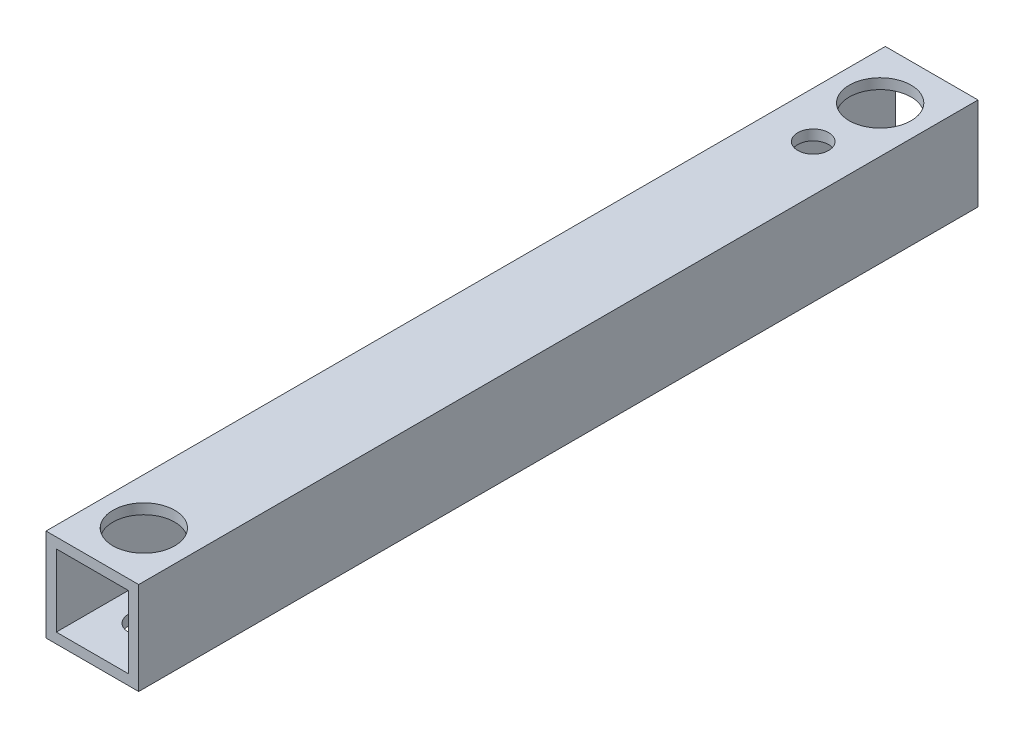
ISO-10303-21;
HEADER;
FILE_DESCRIPTION(('STEP AP214'),'2;1');
FILE_NAME('part.step','',(''),(''),'','','');
FILE_SCHEMA(('AUTOMOTIVE_DESIGN { 1 0 10303 214 1 1 1 1 }'));
ENDSEC;
DATA;
#1=APPLICATION_CONTEXT('core data for automotive mechanical design processes');
#2=APPLICATION_PROTOCOL_DEFINITION('international standard','automotive_design',2000,#1);
#3=PRODUCT_CONTEXT('',#1,'mechanical');
#4=PRODUCT('Part','Part','',(#3));
#5=PRODUCT_RELATED_PRODUCT_CATEGORY('part','',(#4));
#6=PRODUCT_DEFINITION_FORMATION('','',#4);
#7=PRODUCT_DEFINITION_CONTEXT('part definition',#1,'design');
#8=PRODUCT_DEFINITION('design','',#6,#7);
#9=PRODUCT_DEFINITION_SHAPE('','',#8);
#10=(LENGTH_UNIT() NAMED_UNIT(*) SI_UNIT(.MILLI.,.METRE.));
#11=(NAMED_UNIT(*) PLANE_ANGLE_UNIT() SI_UNIT($,.RADIAN.));
#12=(NAMED_UNIT(*) SI_UNIT($,.STERADIAN.) SOLID_ANGLE_UNIT());
#13=UNCERTAINTY_MEASURE_WITH_UNIT(LENGTH_MEASURE(1.E-05),#10,'distance_accuracy_value','');
#14=(GEOMETRIC_REPRESENTATION_CONTEXT(3) GLOBAL_UNCERTAINTY_ASSIGNED_CONTEXT((#13)) GLOBAL_UNIT_ASSIGNED_CONTEXT((#10,
#11,#12)) REPRESENTATION_CONTEXT('',''));
#15=CARTESIAN_POINT('',(0.,0.,0.));
#16=DIRECTION('',(0.,0.,1.));
#17=DIRECTION('',(1.,0.,0.));
#18=AXIS2_PLACEMENT_3D('',#15,#16,#17);
#19=CARTESIAN_POINT('',(4.5,4.5,81.5));
#20=DIRECTION('',(-1.,0.,0.));
#21=DIRECTION('',(0.,0.,1.));
#22=AXIS2_PLACEMENT_3D('',#19,#20,#21);
#23=PLANE('',#22);
#24=DIRECTION('',(0.,1.,0.));
#25=VECTOR('',#24,1.);
#26=CARTESIAN_POINT('',(4.5,4.5,0.));
#27=LINE('',#26,#25);
#28=CARTESIAN_POINT('',(4.5,-4.5,0.));
#29=VERTEX_POINT('',#28);
#30=CARTESIAN_POINT('',(4.5,4.5,0.));
#31=VERTEX_POINT('',#30);
#32=EDGE_CURVE('E136',#29,#31,#27,.T.);
#33=ORIENTED_EDGE('',*,*,#32,.T.);
#34=DIRECTION('',(0.,0.,-1.));
#35=VECTOR('',#34,1.);
#36=CARTESIAN_POINT('',(4.5,4.5,81.5));
#37=LINE('',#36,#35);
#38=CARTESIAN_POINT('',(4.5,4.5,81.5));
#39=VERTEX_POINT('',#38);
#40=EDGE_CURVE('E178',#39,#31,#37,.T.);
#41=ORIENTED_EDGE('',*,*,#40,.F.);
#42=DIRECTION('',(0.,1.,0.));
#43=VECTOR('',#42,1.);
#44=CARTESIAN_POINT('',(4.5,4.5,81.5));
#45=LINE('',#44,#43);
#46=CARTESIAN_POINT('',(4.5,-4.5,81.5));
#47=VERTEX_POINT('',#46);
#48=EDGE_CURVE('E141',#47,#39,#45,.T.);
#49=ORIENTED_EDGE('',*,*,#48,.F.);
#50=DIRECTION('',(0.,0.,-1.));
#51=VECTOR('',#50,1.);
#52=CARTESIAN_POINT('',(4.5,-4.5,81.5));
#53=LINE('',#52,#51);
#54=EDGE_CURVE('E155',#47,#29,#53,.T.);
#55=ORIENTED_EDGE('',*,*,#54,.T.);
#56=EDGE_LOOP('',(#33,#41,#49,#55));
#57=FACE_BOUND('',#56,.T.);
#58=ADVANCED_FACE('F38',(#57),#23,.F.);
#59=CARTESIAN_POINT('',(-4.5,4.5,81.5));
#60=DIRECTION('',(0.,-1.,0.));
#61=DIRECTION('',(0.,0.,-1.));
#62=AXIS2_PLACEMENT_3D('',#59,#60,#61);
#63=PLANE('',#62);
#64=CARTESIAN_POINT('',(0.,4.5,76.5));
#65=DIRECTION('',(0.,1.,0.));
#66=DIRECTION('',(0.,0.,1.));
#67=AXIS2_PLACEMENT_3D('',#64,#65,#66);
#68=CIRCLE('',#67,3.);
#69=CARTESIAN_POINT('',(0.,4.5,79.5));
#70=VERTEX_POINT('',#69);
#71=EDGE_CURVE('E211',#70,#70,#68,.T.);
#72=ORIENTED_EDGE('',*,*,#71,.F.);
#73=EDGE_LOOP('',(#72));
#74=FACE_BOUND('',#73,.T.);
#75=CARTESIAN_POINT('',(0.,4.5,5.));
#76=DIRECTION('',(0.,1.,0.));
#77=DIRECTION('',(0.,0.,1.));
#78=AXIS2_PLACEMENT_3D('',#75,#76,#77);
#79=CIRCLE('',#78,3.);
#80=CARTESIAN_POINT('',(0.,4.5,8.));
#81=VERTEX_POINT('',#80);
#82=EDGE_CURVE('E193',#81,#81,#79,.T.);
#83=ORIENTED_EDGE('',*,*,#82,.F.);
#84=EDGE_LOOP('',(#83));
#85=FACE_BOUND('',#84,.T.);
#86=CARTESIAN_POINT('',(0.,4.5,11.5));
#87=DIRECTION('',(0.,1.,0.));
#88=DIRECTION('',(0.,0.,1.));
#89=AXIS2_PLACEMENT_3D('',#86,#87,#88);
#90=CIRCLE('',#89,1.5);
#91=CARTESIAN_POINT('',(0.,4.5,13.));
#92=VERTEX_POINT('',#91);
#93=EDGE_CURVE('E202',#92,#92,#90,.T.);
#94=ORIENTED_EDGE('',*,*,#93,.F.);
#95=EDGE_LOOP('',(#94));
#96=FACE_BOUND('',#95,.T.);
#97=DIRECTION('',(-1.,0.,0.));
#98=VECTOR('',#97,1.);
#99=CARTESIAN_POINT('',(-4.5,4.5,0.));
#100=LINE('',#99,#98);
#101=CARTESIAN_POINT('',(-4.5,4.5,0.));
#102=VERTEX_POINT('',#101);
#103=EDGE_CURVE('E159',#31,#102,#100,.T.);
#104=ORIENTED_EDGE('',*,*,#103,.T.);
#105=DIRECTION('',(0.,0.,-1.));
#106=VECTOR('',#105,1.);
#107=CARTESIAN_POINT('',(-4.5,4.5,81.5));
#108=LINE('',#107,#106);
#109=CARTESIAN_POINT('',(-4.5,4.5,81.5));
#110=VERTEX_POINT('',#109);
#111=EDGE_CURVE('E174',#110,#102,#108,.T.);
#112=ORIENTED_EDGE('',*,*,#111,.F.);
#113=DIRECTION('',(-1.,0.,0.));
#114=VECTOR('',#113,1.);
#115=CARTESIAN_POINT('',(-4.5,4.5,81.5));
#116=LINE('',#115,#114);
#117=EDGE_CURVE('E145',#39,#110,#116,.T.);
#118=ORIENTED_EDGE('',*,*,#117,.F.);
#119=ORIENTED_EDGE('',*,*,#40,.T.);
#120=EDGE_LOOP('',(#104,#112,#118,#119));
#121=FACE_BOUND('',#120,.T.);
#122=ADVANCED_FACE('F258',(#74,#85,#96,#121),#63,.F.);
#123=CARTESIAN_POINT('',(-4.5,4.5,81.5));
#124=DIRECTION('',(1.,0.,0.));
#125=DIRECTION('',(0.,1.,0.));
#126=AXIS2_PLACEMENT_3D('',#123,#124,#125);
#127=PLANE('',#126);
#128=DIRECTION('',(0.,-1.,0.));
#129=VECTOR('',#128,1.);
#130=CARTESIAN_POINT('',(-4.5,4.5,0.));
#131=LINE('',#130,#129);
#132=CARTESIAN_POINT('',(-4.5,-4.5,0.));
#133=VERTEX_POINT('',#132);
#134=EDGE_CURVE('E162',#102,#133,#131,.T.);
#135=ORIENTED_EDGE('',*,*,#134,.T.);
#136=DIRECTION('',(0.,0.,-1.));
#137=VECTOR('',#136,1.);
#138=CARTESIAN_POINT('',(-4.5,-4.5,81.5));
#139=LINE('',#138,#137);
#140=CARTESIAN_POINT('',(-4.5,-4.5,81.5));
#141=VERTEX_POINT('',#140);
#142=EDGE_CURVE('E170',#141,#133,#139,.T.);
#143=ORIENTED_EDGE('',*,*,#142,.F.);
#144=DIRECTION('',(0.,-1.,0.));
#145=VECTOR('',#144,1.);
#146=CARTESIAN_POINT('',(-4.5,4.5,81.5));
#147=LINE('',#146,#145);
#148=EDGE_CURVE('E149',#110,#141,#147,.T.);
#149=ORIENTED_EDGE('',*,*,#148,.F.);
#150=ORIENTED_EDGE('',*,*,#111,.T.);
#151=EDGE_LOOP('',(#135,#143,#149,#150));
#152=FACE_BOUND('',#151,.T.);
#153=ADVANCED_FACE('F264',(#152),#127,.F.);
#154=CARTESIAN_POINT('',(-4.5,-4.5,81.5));
#155=DIRECTION('',(0.,1.,0.));
#156=DIRECTION('',(0.,0.,1.));
#157=AXIS2_PLACEMENT_3D('',#154,#155,#156);
#158=PLANE('',#157);
#159=CARTESIAN_POINT('',(0.,-4.5,5.));
#160=DIRECTION('',(0.,1.,0.));
#161=DIRECTION('',(0.,0.,1.));
#162=AXIS2_PLACEMENT_3D('',#159,#160,#161);
#163=CIRCLE('',#162,3.);
#164=CARTESIAN_POINT('',(0.,-4.5,8.));
#165=VERTEX_POINT('',#164);
#166=EDGE_CURVE('E229',#165,#165,#163,.T.);
#167=ORIENTED_EDGE('',*,*,#166,.T.);
#168=EDGE_LOOP('',(#167));
#169=FACE_BOUND('',#168,.T.);
#170=CARTESIAN_POINT('',(0.,-4.5,76.5));
#171=DIRECTION('',(0.,1.,0.));
#172=DIRECTION('',(0.,0.,1.));
#173=AXIS2_PLACEMENT_3D('',#170,#171,#172);
#174=CIRCLE('',#173,1.5);
#175=CARTESIAN_POINT('',(0.,-4.5,78.));
#176=VERTEX_POINT('',#175);
#177=EDGE_CURVE('E221',#176,#176,#174,.T.);
#178=ORIENTED_EDGE('',*,*,#177,.T.);
#179=EDGE_LOOP('',(#178));
#180=FACE_BOUND('',#179,.T.);
#181=CARTESIAN_POINT('',(0.,-4.5,11.5));
#182=DIRECTION('',(0.,1.,0.));
#183=DIRECTION('',(0.,0.,1.));
#184=AXIS2_PLACEMENT_3D('',#181,#182,#183);
#185=CIRCLE('',#184,1.5);
#186=CARTESIAN_POINT('',(0.,-4.5,13.));
#187=VERTEX_POINT('',#186);
#188=EDGE_CURVE('E199',#187,#187,#185,.T.);
#189=ORIENTED_EDGE('',*,*,#188,.T.);
#190=EDGE_LOOP('',(#189));
#191=FACE_BOUND('',#190,.T.);
#192=DIRECTION('',(1.,0.,0.));
#193=VECTOR('',#192,1.);
#194=CARTESIAN_POINT('',(-4.5,-4.5,0.));
#195=LINE('',#194,#193);
#196=EDGE_CURVE('E146',#133,#29,#195,.T.);
#197=ORIENTED_EDGE('',*,*,#196,.T.);
#198=ORIENTED_EDGE('',*,*,#54,.F.);
#199=DIRECTION('',(1.,0.,0.));
#200=VECTOR('',#199,1.);
#201=CARTESIAN_POINT('',(-4.5,-4.5,81.5));
#202=LINE('',#201,#200);
#203=EDGE_CURVE('E152',#141,#47,#202,.T.);
#204=ORIENTED_EDGE('',*,*,#203,.F.);
#205=ORIENTED_EDGE('',*,*,#142,.T.);
#206=EDGE_LOOP('',(#197,#198,#204,#205));
#207=FACE_BOUND('',#206,.T.);
#208=ADVANCED_FACE('F280',(#169,#180,#191,#207),#158,.F.);
#209=CARTESIAN_POINT('',(0.,0.,81.5));
#210=DIRECTION('',(0.,0.,1.));
#211=DIRECTION('',(1.,0.,0.));
#212=AXIS2_PLACEMENT_3D('',#209,#210,#211);
#213=PLANE('',#212);
#214=DIRECTION('',(0.,1.,0.));
#215=VECTOR('',#214,1.);
#216=CARTESIAN_POINT('',(3.5,3.5,81.5));
#217=LINE('',#216,#215);
#218=CARTESIAN_POINT('',(3.5,-3.5,81.5));
#219=VERTEX_POINT('',#218);
#220=CARTESIAN_POINT('',(3.5,3.5,81.5));
#221=VERTEX_POINT('',#220);
#222=EDGE_CURVE('E55',#219,#221,#217,.T.);
#223=ORIENTED_EDGE('',*,*,#222,.F.);
#224=DIRECTION('',(1.,0.,0.));
#225=VECTOR('',#224,1.);
#226=CARTESIAN_POINT('',(-3.5,-3.5,81.5));
#227=LINE('',#226,#225);
#228=CARTESIAN_POINT('',(-3.5,-3.5,81.5));
#229=VERTEX_POINT('',#228);
#230=EDGE_CURVE('E126',#229,#219,#227,.T.);
#231=ORIENTED_EDGE('',*,*,#230,.F.);
#232=DIRECTION('',(0.,-1.,0.));
#233=VECTOR('',#232,1.);
#234=CARTESIAN_POINT('',(-3.5,3.5,81.5));
#235=LINE('',#234,#233);
#236=CARTESIAN_POINT('',(-3.5,3.5,81.5));
#237=VERTEX_POINT('',#236);
#238=EDGE_CURVE('E108',#237,#229,#235,.T.);
#239=ORIENTED_EDGE('',*,*,#238,.F.);
#240=DIRECTION('',(-1.,0.,0.));
#241=VECTOR('',#240,1.);
#242=CARTESIAN_POINT('',(-3.5,3.5,81.5));
#243=LINE('',#242,#241);
#244=EDGE_CURVE('E118',#221,#237,#243,.T.);
#245=ORIENTED_EDGE('',*,*,#244,.F.);
#246=EDGE_LOOP('',(#223,#231,#239,#245));
#247=FACE_BOUND('',#246,.T.);
#248=ORIENTED_EDGE('',*,*,#48,.T.);
#249=ORIENTED_EDGE('',*,*,#117,.T.);
#250=ORIENTED_EDGE('',*,*,#148,.T.);
#251=ORIENTED_EDGE('',*,*,#203,.T.);
#252=EDGE_LOOP('',(#248,#249,#250,#251));
#253=FACE_BOUND('',#252,.T.);
#254=ADVANCED_FACE('F123',(#247,#253),#213,.T.);
#255=CARTESIAN_POINT('',(0.,0.,0.));
#256=DIRECTION('',(0.,0.,1.));
#257=DIRECTION('',(1.,0.,0.));
#258=AXIS2_PLACEMENT_3D('',#255,#256,#257);
#259=PLANE('',#258);
#260=DIRECTION('',(1.,0.,0.));
#261=VECTOR('',#260,1.);
#262=CARTESIAN_POINT('',(0.,-3.5,0.));
#263=LINE('',#262,#261);
#264=CARTESIAN_POINT('',(-3.5,-3.5,0.));
#265=VERTEX_POINT('',#264);
#266=CARTESIAN_POINT('',(3.5,-3.5,0.));
#267=VERTEX_POINT('',#266);
#268=EDGE_CURVE('E47',#265,#267,#263,.T.);
#269=ORIENTED_EDGE('',*,*,#268,.T.);
#270=DIRECTION('',(0.,1.,0.));
#271=VECTOR('',#270,1.);
#272=CARTESIAN_POINT('',(3.5,0.,0.));
#273=LINE('',#272,#271);
#274=CARTESIAN_POINT('',(3.5,3.5,0.));
#275=VERTEX_POINT('',#274);
#276=EDGE_CURVE('E11',#267,#275,#273,.T.);
#277=ORIENTED_EDGE('',*,*,#276,.T.);
#278=DIRECTION('',(-1.,0.,0.));
#279=VECTOR('',#278,1.);
#280=CARTESIAN_POINT('',(0.,3.5,0.));
#281=LINE('',#280,#279);
#282=CARTESIAN_POINT('',(-3.5,3.5,0.));
#283=VERTEX_POINT('',#282);
#284=EDGE_CURVE('E182',#275,#283,#281,.T.);
#285=ORIENTED_EDGE('',*,*,#284,.T.);
#286=DIRECTION('',(0.,-1.,0.));
#287=VECTOR('',#286,1.);
#288=CARTESIAN_POINT('',(-3.5,0.,0.));
#289=LINE('',#288,#287);
#290=EDGE_CURVE('E111',#283,#265,#289,.T.);
#291=ORIENTED_EDGE('',*,*,#290,.T.);
#292=EDGE_LOOP('',(#269,#277,#285,#291));
#293=FACE_BOUND('',#292,.T.);
#294=ORIENTED_EDGE('',*,*,#32,.F.);
#295=ORIENTED_EDGE('',*,*,#196,.F.);
#296=ORIENTED_EDGE('',*,*,#134,.F.);
#297=ORIENTED_EDGE('',*,*,#103,.F.);
#298=EDGE_LOOP('',(#294,#295,#296,#297));
#299=FACE_BOUND('',#298,.T.);
#300=ADVANCED_FACE('F272',(#293,#299),#259,.F.);
#301=CARTESIAN_POINT('',(3.5,3.5,-20.));
#302=DIRECTION('',(1.,0.,0.));
#303=DIRECTION('',(0.,1.,0.));
#304=AXIS2_PLACEMENT_3D('',#301,#302,#303);
#305=PLANE('',#304);
#306=DIRECTION('',(0.,0.,1.));
#307=VECTOR('',#306,1.);
#308=CARTESIAN_POINT('',(3.5,-3.5,-20.));
#309=LINE('',#308,#307);
#310=EDGE_CURVE('E133',#267,#219,#309,.T.);
#311=ORIENTED_EDGE('',*,*,#310,.T.);
#312=ORIENTED_EDGE('',*,*,#222,.T.);
#313=DIRECTION('',(0.,0.,1.));
#314=VECTOR('',#313,1.);
#315=CARTESIAN_POINT('',(3.5,3.5,-20.));
#316=LINE('',#315,#314);
#317=EDGE_CURVE('E115',#275,#221,#316,.T.);
#318=ORIENTED_EDGE('',*,*,#317,.F.);
#319=ORIENTED_EDGE('',*,*,#276,.F.);
#320=EDGE_LOOP('',(#311,#312,#318,#319));
#321=FACE_BOUND('',#320,.T.);
#322=ADVANCED_FACE('F292',(#321),#305,.F.);
#323=CARTESIAN_POINT('',(-3.5,-3.5,-20.));
#324=DIRECTION('',(0.,-1.,0.));
#325=DIRECTION('',(0.,0.,-1.));
#326=AXIS2_PLACEMENT_3D('',#323,#324,#325);
#327=PLANE('',#326);
#328=CARTESIAN_POINT('',(0.,-3.5,5.));
#329=DIRECTION('',(0.,-1.,0.));
#330=DIRECTION('',(0.,0.,-1.));
#331=AXIS2_PLACEMENT_3D('',#328,#329,#330);
#332=CIRCLE('',#331,3.);
#333=CARTESIAN_POINT('',(0.,-3.5,2.));
#334=VERTEX_POINT('',#333);
#335=EDGE_CURVE('E225',#334,#334,#332,.T.);
#336=ORIENTED_EDGE('',*,*,#335,.T.);
#337=EDGE_LOOP('',(#336));
#338=FACE_BOUND('',#337,.T.);
#339=CARTESIAN_POINT('',(0.,-3.5,76.5));
#340=DIRECTION('',(0.,-1.,0.));
#341=DIRECTION('',(0.,0.,-1.));
#342=AXIS2_PLACEMENT_3D('',#339,#340,#341);
#343=CIRCLE('',#342,1.5);
#344=CARTESIAN_POINT('',(0.,-3.5,75.));
#345=VERTEX_POINT('',#344);
#346=EDGE_CURVE('E217',#345,#345,#343,.T.);
#347=ORIENTED_EDGE('',*,*,#346,.T.);
#348=EDGE_LOOP('',(#347));
#349=FACE_BOUND('',#348,.T.);
#350=CARTESIAN_POINT('',(0.,-3.5,11.5));
#351=DIRECTION('',(0.,-1.,0.));
#352=DIRECTION('',(0.,0.,-1.));
#353=AXIS2_PLACEMENT_3D('',#350,#351,#352);
#354=CIRCLE('',#353,1.5);
#355=CARTESIAN_POINT('',(0.,-3.5,10.));
#356=VERTEX_POINT('',#355);
#357=EDGE_CURVE('E192',#356,#356,#354,.T.);
#358=ORIENTED_EDGE('',*,*,#357,.T.);
#359=EDGE_LOOP('',(#358));
#360=FACE_BOUND('',#359,.T.);
#361=DIRECTION('',(0.,0.,1.));
#362=VECTOR('',#361,1.);
#363=CARTESIAN_POINT('',(-3.5,-3.5,-20.));
#364=LINE('',#363,#362);
#365=EDGE_CURVE('E114',#265,#229,#364,.T.);
#366=ORIENTED_EDGE('',*,*,#365,.T.);
#367=ORIENTED_EDGE('',*,*,#230,.T.);
#368=ORIENTED_EDGE('',*,*,#310,.F.);
#369=ORIENTED_EDGE('',*,*,#268,.F.);
#370=EDGE_LOOP('',(#366,#367,#368,#369));
#371=FACE_BOUND('',#370,.T.);
#372=ADVANCED_FACE('F298',(#338,#349,#360,#371),#327,.F.);
#373=CARTESIAN_POINT('',(-3.5,3.5,-20.));
#374=DIRECTION('',(-1.,0.,0.));
#375=DIRECTION('',(0.,-1.,0.));
#376=AXIS2_PLACEMENT_3D('',#373,#374,#375);
#377=PLANE('',#376);
#378=DIRECTION('',(0.,0.,1.));
#379=VECTOR('',#378,1.);
#380=CARTESIAN_POINT('',(-3.5,3.5,-20.));
#381=LINE('',#380,#379);
#382=EDGE_CURVE('E63',#283,#237,#381,.T.);
#383=ORIENTED_EDGE('',*,*,#382,.T.);
#384=ORIENTED_EDGE('',*,*,#238,.T.);
#385=ORIENTED_EDGE('',*,*,#365,.F.);
#386=ORIENTED_EDGE('',*,*,#290,.F.);
#387=EDGE_LOOP('',(#383,#384,#385,#386));
#388=FACE_BOUND('',#387,.T.);
#389=ADVANCED_FACE('F105',(#388),#377,.F.);
#390=CARTESIAN_POINT('',(-3.5,3.5,-20.));
#391=DIRECTION('',(0.,1.,0.));
#392=DIRECTION('',(0.,0.,1.));
#393=AXIS2_PLACEMENT_3D('',#390,#391,#392);
#394=PLANE('',#393);
#395=CARTESIAN_POINT('',(0.,3.5,76.5));
#396=DIRECTION('',(0.,1.,0.));
#397=DIRECTION('',(0.,0.,1.));
#398=AXIS2_PLACEMENT_3D('',#395,#396,#397);
#399=CIRCLE('',#398,3.);
#400=CARTESIAN_POINT('',(0.,3.5,79.5));
#401=VERTEX_POINT('',#400);
#402=EDGE_CURVE('E208',#401,#401,#399,.T.);
#403=ORIENTED_EDGE('',*,*,#402,.T.);
#404=EDGE_LOOP('',(#403));
#405=FACE_BOUND('',#404,.T.);
#406=CARTESIAN_POINT('',(0.,3.5,5.));
#407=DIRECTION('',(0.,1.,0.));
#408=DIRECTION('',(0.,0.,1.));
#409=AXIS2_PLACEMENT_3D('',#406,#407,#408);
#410=CIRCLE('',#409,3.);
#411=CARTESIAN_POINT('',(0.,3.5,8.));
#412=VERTEX_POINT('',#411);
#413=EDGE_CURVE('E41',#412,#412,#410,.T.);
#414=ORIENTED_EDGE('',*,*,#413,.T.);
#415=EDGE_LOOP('',(#414));
#416=FACE_BOUND('',#415,.T.);
#417=CARTESIAN_POINT('',(0.,3.5,11.5));
#418=DIRECTION('',(0.,1.,0.));
#419=DIRECTION('',(0.,0.,1.));
#420=AXIS2_PLACEMENT_3D('',#417,#418,#419);
#421=CIRCLE('',#420,1.5);
#422=CARTESIAN_POINT('',(0.,3.5,13.));
#423=VERTEX_POINT('',#422);
#424=EDGE_CURVE('E189',#423,#423,#421,.T.);
#425=ORIENTED_EDGE('',*,*,#424,.T.);
#426=EDGE_LOOP('',(#425));
#427=FACE_BOUND('',#426,.T.);
#428=ORIENTED_EDGE('',*,*,#317,.T.);
#429=ORIENTED_EDGE('',*,*,#244,.T.);
#430=ORIENTED_EDGE('',*,*,#382,.F.);
#431=ORIENTED_EDGE('',*,*,#284,.F.);
#432=EDGE_LOOP('',(#428,#429,#430,#431));
#433=FACE_BOUND('',#432,.T.);
#434=ADVANCED_FACE('F119',(#405,#416,#427,#433),#394,.F.);
#435=CARTESIAN_POINT('',(0.,-107.,11.5));
#436=DIRECTION('',(0.,1.,0.));
#437=DIRECTION('',(0.,0.,1.));
#438=AXIS2_PLACEMENT_3D('',#435,#436,#437);
#439=CYLINDRICAL_SURFACE('',#438,1.5);
#440=ORIENTED_EDGE('',*,*,#93,.T.);
#441=EDGE_LOOP('',(#440));
#442=FACE_BOUND('',#441,.T.);
#443=ORIENTED_EDGE('',*,*,#424,.F.);
#444=EDGE_LOOP('',(#443));
#445=FACE_BOUND('',#444,.T.);
#446=ADVANCED_FACE('F241',(#442,#445),#439,.F.);
#447=CARTESIAN_POINT('',(0.,-107.,5.));
#448=DIRECTION('',(0.,1.,0.));
#449=DIRECTION('',(0.,0.,1.));
#450=AXIS2_PLACEMENT_3D('',#447,#448,#449);
#451=CYLINDRICAL_SURFACE('',#450,3.);
#452=ORIENTED_EDGE('',*,*,#82,.T.);
#453=EDGE_LOOP('',(#452));
#454=FACE_BOUND('',#453,.T.);
#455=ORIENTED_EDGE('',*,*,#413,.F.);
#456=EDGE_LOOP('',(#455));
#457=FACE_BOUND('',#456,.T.);
#458=ADVANCED_FACE('F238',(#454,#457),#451,.F.);
#459=ORIENTED_EDGE('',*,*,#357,.F.);
#460=EDGE_LOOP('',(#459));
#461=FACE_BOUND('',#460,.T.);
#462=ORIENTED_EDGE('',*,*,#188,.F.);
#463=EDGE_LOOP('',(#462));
#464=FACE_BOUND('',#463,.T.);
#465=ADVANCED_FACE('F240',(#461,#464),#439,.F.);
#466=CARTESIAN_POINT('',(0.,-107.,76.5));
#467=DIRECTION('',(0.,1.,0.));
#468=DIRECTION('',(0.,0.,1.));
#469=AXIS2_PLACEMENT_3D('',#466,#467,#468);
#470=CYLINDRICAL_SURFACE('',#469,1.5);
#471=ORIENTED_EDGE('',*,*,#346,.F.);
#472=EDGE_LOOP('',(#471));
#473=FACE_BOUND('',#472,.T.);
#474=ORIENTED_EDGE('',*,*,#177,.F.);
#475=EDGE_LOOP('',(#474));
#476=FACE_BOUND('',#475,.T.);
#477=ADVANCED_FACE('F248',(#473,#476),#470,.F.);
#478=ORIENTED_EDGE('',*,*,#335,.F.);
#479=EDGE_LOOP('',(#478));
#480=FACE_BOUND('',#479,.T.);
#481=ORIENTED_EDGE('',*,*,#166,.F.);
#482=EDGE_LOOP('',(#481));
#483=FACE_BOUND('',#482,.T.);
#484=ADVANCED_FACE('F243',(#480,#483),#451,.F.);
#485=CARTESIAN_POINT('',(0.,3.5,76.5));
#486=DIRECTION('',(0.,1.,0.));
#487=DIRECTION('',(0.,0.,1.));
#488=AXIS2_PLACEMENT_3D('',#485,#486,#487);
#489=CYLINDRICAL_SURFACE('',#488,3.);
#490=ORIENTED_EDGE('',*,*,#402,.F.);
#491=EDGE_LOOP('',(#490));
#492=FACE_BOUND('',#491,.T.);
#493=ORIENTED_EDGE('',*,*,#71,.T.);
#494=EDGE_LOOP('',(#493));
#495=FACE_BOUND('',#494,.T.);
#496=ADVANCED_FACE('F255',(#492,#495),#489,.F.);
#497=CLOSED_SHELL('',(#58,#122,#153,#208,#254,#300,#322,#372,#389,#434,#446,#458,#465,#477,#484,#496));
#498=MANIFOLD_SOLID_BREP('B2',#497);
#499=ADVANCED_BREP_SHAPE_REPRESENTATION('',(#18,#498),#14);
#500=SHAPE_DEFINITION_REPRESENTATION(#9,#499);
ENDSEC;
END-ISO-10303-21;
